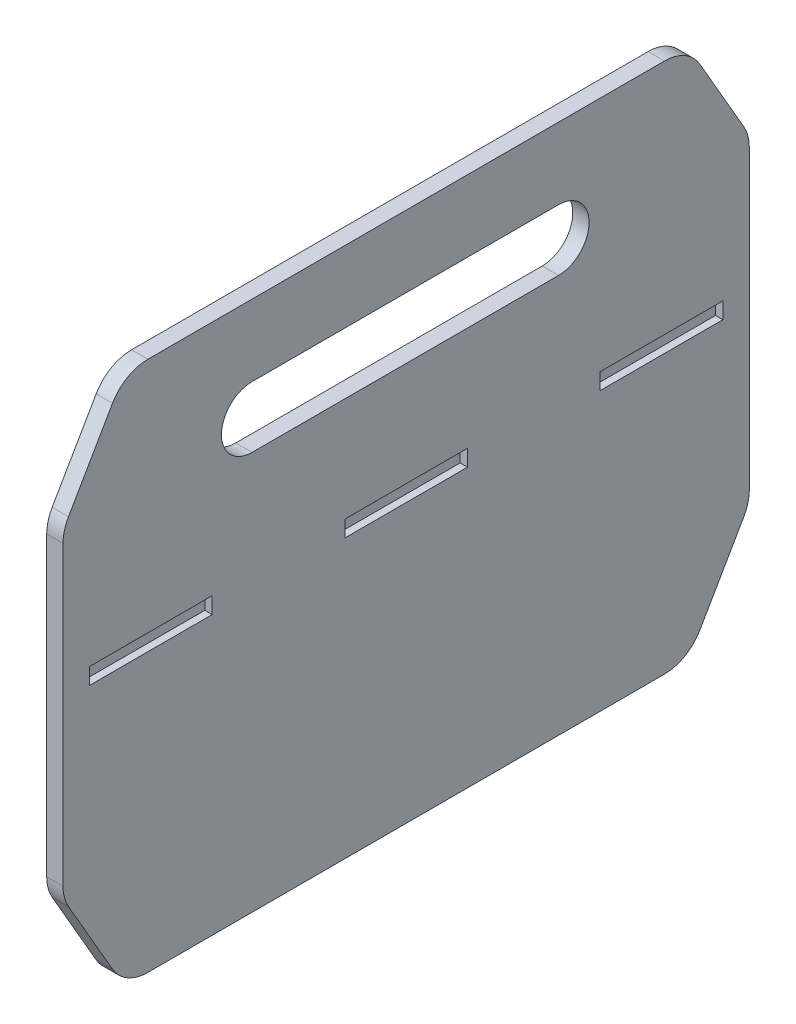
ISO-10303-21;
HEADER;
FILE_DESCRIPTION(('STEP AP214'),'2;1');
FILE_NAME('part.step','',(''),(''),'','','');
FILE_SCHEMA(('AUTOMOTIVE_DESIGN { 1 0 10303 214 1 1 1 1 }'));
ENDSEC;
DATA;
#1=APPLICATION_CONTEXT('core data for automotive mechanical design processes');
#2=APPLICATION_PROTOCOL_DEFINITION('international standard','automotive_design',2000,#1);
#3=PRODUCT_CONTEXT('',#1,'mechanical');
#4=PRODUCT('Part','Part','',(#3));
#5=PRODUCT_RELATED_PRODUCT_CATEGORY('part','',(#4));
#6=PRODUCT_DEFINITION_FORMATION('','',#4);
#7=PRODUCT_DEFINITION_CONTEXT('part definition',#1,'design');
#8=PRODUCT_DEFINITION('design','',#6,#7);
#9=PRODUCT_DEFINITION_SHAPE('','',#8);
#10=(LENGTH_UNIT() NAMED_UNIT(*) SI_UNIT(.MILLI.,.METRE.));
#11=(NAMED_UNIT(*) PLANE_ANGLE_UNIT() SI_UNIT($,.RADIAN.));
#12=(NAMED_UNIT(*) SI_UNIT($,.STERADIAN.) SOLID_ANGLE_UNIT());
#13=UNCERTAINTY_MEASURE_WITH_UNIT(LENGTH_MEASURE(1.E-05),#10,'distance_accuracy_value','');
#14=(GEOMETRIC_REPRESENTATION_CONTEXT(3) GLOBAL_UNCERTAINTY_ASSIGNED_CONTEXT((#13)) GLOBAL_UNIT_ASSIGNED_CONTEXT((#10,
#11,#12)) REPRESENTATION_CONTEXT('',''));
#15=CARTESIAN_POINT('',(0.,0.,0.));
#16=DIRECTION('',(0.,0.,1.));
#17=DIRECTION('',(1.,0.,0.));
#18=AXIS2_PLACEMENT_3D('',#15,#16,#17);
#19=CARTESIAN_POINT('',(-10.16,0.,212.802604436161));
#20=DIRECTION('',(0.,0.,1.));
#21=DIRECTION('',(1.,0.,0.));
#22=AXIS2_PLACEMENT_3D('',#19,#20,#21);
#23=PLANE('',#22);
#24=DIRECTION('',(0.,-1.,0.));
#25=VECTOR('',#24,1.);
#26=CARTESIAN_POINT('',(0.,0.,212.802604436161));
#27=LINE('',#26,#25);
#28=CARTESIAN_POINT('',(0.,206.602954743875,212.802604436161));
#29=VERTEX_POINT('',#28);
#30=CARTESIAN_POINT('',(0.,21.9970452561246,212.802604436161));
#31=VERTEX_POINT('',#30);
#32=EDGE_CURVE('E391',#29,#31,#27,.T.);
#33=ORIENTED_EDGE('',*,*,#32,.F.);
#34=DIRECTION('',(1.,0.,0.));
#35=VECTOR('',#34,1.);
#36=CARTESIAN_POINT('',(-10.16,206.602954743875,212.802604436161));
#37=LINE('',#36,#35);
#38=CARTESIAN_POINT('',(-10.16,206.602954743875,212.802604436161));
#39=VERTEX_POINT('',#38);
#40=EDGE_CURVE('E477',#29,#39,#37,.F.);
#41=ORIENTED_EDGE('',*,*,#40,.T.);
#42=DIRECTION('',(0.,-1.,0.));
#43=VECTOR('',#42,1.);
#44=CARTESIAN_POINT('',(-10.16,0.,212.802604436161));
#45=LINE('',#44,#43);
#46=CARTESIAN_POINT('',(-10.16,21.9970452561246,212.802604436161));
#47=VERTEX_POINT('',#46);
#48=EDGE_CURVE('E387',#39,#47,#45,.T.);
#49=ORIENTED_EDGE('',*,*,#48,.T.);
#50=DIRECTION('',(-1.,0.,0.));
#51=VECTOR('',#50,1.);
#52=CARTESIAN_POINT('',(-10.16,21.9970452561246,212.802604436161));
#53=LINE('',#52,#51);
#54=EDGE_CURVE('E474',#47,#31,#53,.F.);
#55=ORIENTED_EDGE('',*,*,#54,.T.);
#56=EDGE_LOOP('',(#33,#41,#49,#55));
#57=FACE_BOUND('',#56,.T.);
#58=ADVANCED_FACE('F40',(#57),#23,.T.);
#59=CARTESIAN_POINT('',(-10.16,279.4,212.802604436161));
#60=DIRECTION('',(0.,1.,0.));
#61=DIRECTION('',(0.,0.,1.));
#62=AXIS2_PLACEMENT_3D('',#59,#60,#61);
#63=PLANE('',#62);
#64=DIRECTION('',(0.,0.,1.));
#65=VECTOR('',#64,1.);
#66=CARTESIAN_POINT('',(-10.16,279.4,212.802604436161));
#67=LINE('',#66,#65);
#68=CARTESIAN_POINT('',(-10.16,279.4,-161.152698726423));
#69=VERTEX_POINT('',#68);
#70=CARTESIAN_POINT('',(-10.16,279.4,160.037907598744));
#71=VERTEX_POINT('',#70);
#72=EDGE_CURVE('E397',#69,#71,#67,.T.);
#73=ORIENTED_EDGE('',*,*,#72,.T.);
#74=DIRECTION('',(-1.,0.,0.));
#75=VECTOR('',#74,1.);
#76=CARTESIAN_POINT('',(-10.16,279.4,160.037907598744));
#77=LINE('',#76,#75);
#78=CARTESIAN_POINT('',(0.,279.4,160.037907598744));
#79=VERTEX_POINT('',#78);
#80=EDGE_CURVE('E436',#71,#79,#77,.F.);
#81=ORIENTED_EDGE('',*,*,#80,.T.);
#82=DIRECTION('',(0.,0.,1.));
#83=VECTOR('',#82,1.);
#84=CARTESIAN_POINT('',(0.,279.4,212.802604436161));
#85=LINE('',#84,#83);
#86=CARTESIAN_POINT('',(0.,279.4,-161.152698726423));
#87=VERTEX_POINT('',#86);
#88=EDGE_CURVE('E406',#87,#79,#85,.T.);
#89=ORIENTED_EDGE('',*,*,#88,.F.);
#90=DIRECTION('',(1.,0.,0.));
#91=VECTOR('',#90,1.);
#92=CARTESIAN_POINT('',(-10.16,279.4,-161.152698726423));
#93=LINE('',#92,#91);
#94=EDGE_CURVE('E433',#87,#69,#93,.F.);
#95=ORIENTED_EDGE('',*,*,#94,.T.);
#96=EDGE_LOOP('',(#73,#81,#89,#95));
#97=FACE_BOUND('',#96,.T.);
#98=ADVANCED_FACE('F508',(#97),#63,.T.);
#99=CARTESIAN_POINT('',(-10.16,254.,-213.917395563839));
#100=DIRECTION('',(0.,0.,-1.));
#101=DIRECTION('',(0.,1.,0.));
#102=AXIS2_PLACEMENT_3D('',#99,#100,#101);
#103=PLANE('',#102);
#104=DIRECTION('',(0.,1.,0.));
#105=VECTOR('',#104,1.);
#106=CARTESIAN_POINT('',(0.,254.,-213.917395563839));
#107=LINE('',#106,#105);
#108=CARTESIAN_POINT('',(0.,21.9970452561242,-213.917395563839));
#109=VERTEX_POINT('',#108);
#110=CARTESIAN_POINT('',(0.,206.602954743875,-213.917395563839));
#111=VERTEX_POINT('',#110);
#112=EDGE_CURVE('E403',#109,#111,#107,.T.);
#113=ORIENTED_EDGE('',*,*,#112,.F.);
#114=DIRECTION('',(1.,0.,0.));
#115=VECTOR('',#114,1.);
#116=CARTESIAN_POINT('',(-10.16,21.9970452561242,-213.917395563839));
#117=LINE('',#116,#115);
#118=CARTESIAN_POINT('',(-10.16,21.9970452561242,-213.917395563839));
#119=VERTEX_POINT('',#118);
#120=EDGE_CURVE('E497',#109,#119,#117,.F.);
#121=ORIENTED_EDGE('',*,*,#120,.T.);
#122=DIRECTION('',(0.,1.,0.));
#123=VECTOR('',#122,1.);
#124=CARTESIAN_POINT('',(-10.16,0.,-213.917395563839));
#125=LINE('',#124,#123);
#126=CARTESIAN_POINT('',(-10.16,206.602954743875,-213.917395563839));
#127=VERTEX_POINT('',#126);
#128=EDGE_CURVE('E394',#119,#127,#125,.T.);
#129=ORIENTED_EDGE('',*,*,#128,.T.);
#130=DIRECTION('',(-1.,0.,0.));
#131=VECTOR('',#130,1.);
#132=CARTESIAN_POINT('',(-10.16,206.602954743875,-213.917395563839));
#133=LINE('',#132,#131);
#134=EDGE_CURVE('E494',#127,#111,#133,.F.);
#135=ORIENTED_EDGE('',*,*,#134,.T.);
#136=EDGE_LOOP('',(#113,#121,#129,#135));
#137=FACE_BOUND('',#136,.T.);
#138=ADVANCED_FACE('F561',(#137),#103,.T.);
#139=CARTESIAN_POINT('',(-10.16,-50.8,212.802604436161));
#140=DIRECTION('',(0.,-1.,0.));
#141=DIRECTION('',(0.,0.,-1.));
#142=AXIS2_PLACEMENT_3D('',#139,#140,#141);
#143=PLANE('',#142);
#144=DIRECTION('',(0.,0.,-1.));
#145=VECTOR('',#144,1.);
#146=CARTESIAN_POINT('',(0.,-50.8,212.802604436161));
#147=LINE('',#146,#145);
#148=CARTESIAN_POINT('',(0.,-50.8,160.037907598744));
#149=VERTEX_POINT('',#148);
#150=CARTESIAN_POINT('',(0.,-50.8,-161.152698726423));
#151=VERTEX_POINT('',#150);
#152=EDGE_CURVE('E380',#149,#151,#147,.T.);
#153=ORIENTED_EDGE('',*,*,#152,.F.);
#154=DIRECTION('',(1.,0.,0.));
#155=VECTOR('',#154,1.);
#156=CARTESIAN_POINT('',(-10.16,-50.8,160.037907598744));
#157=LINE('',#156,#155);
#158=CARTESIAN_POINT('',(-10.16,-50.8,160.037907598744));
#159=VERTEX_POINT('',#158);
#160=EDGE_CURVE('E487',#149,#159,#157,.F.);
#161=ORIENTED_EDGE('',*,*,#160,.T.);
#162=DIRECTION('',(0.,0.,-1.));
#163=VECTOR('',#162,1.);
#164=CARTESIAN_POINT('',(-10.16,-50.8,212.802604436161));
#165=LINE('',#164,#163);
#166=CARTESIAN_POINT('',(-10.16,-50.8,-161.152698726423));
#167=VERTEX_POINT('',#166);
#168=EDGE_CURVE('E390',#159,#167,#165,.T.);
#169=ORIENTED_EDGE('',*,*,#168,.T.);
#170=DIRECTION('',(-1.,0.,0.));
#171=VECTOR('',#170,1.);
#172=CARTESIAN_POINT('',(-10.16,-50.8,-161.152698726423));
#173=LINE('',#172,#171);
#174=EDGE_CURVE('E484',#167,#151,#173,.F.);
#175=ORIENTED_EDGE('',*,*,#174,.T.);
#176=EDGE_LOOP('',(#153,#161,#169,#175));
#177=FACE_BOUND('',#176,.T.);
#178=ADVANCED_FACE('F543',(#177),#143,.T.);
#179=CARTESIAN_POINT('',(-10.16,0.,0.));
#180=DIRECTION('',(1.,0.,0.));
#181=DIRECTION('',(0.,0.,-1.));
#182=AXIS2_PLACEMENT_3D('',#179,#180,#181);
#183=PLANE('',#182);
#184=DIRECTION('',(0.,0.,1.));
#185=VECTOR('',#184,1.);
#186=CARTESIAN_POINT('',(-10.16,234.95,95.25));
#187=LINE('',#186,#185);
#188=CARTESIAN_POINT('',(-10.16,234.95,-95.25));
#189=VERTEX_POINT('',#188);
#190=CARTESIAN_POINT('',(-10.16,234.95,95.25));
#191=VERTEX_POINT('',#190);
#192=EDGE_CURVE('E365',#189,#191,#187,.T.);
#193=ORIENTED_EDGE('',*,*,#192,.T.);
#194=CARTESIAN_POINT('',(-10.16,215.9,95.25));
#195=DIRECTION('',(1.,0.,0.));
#196=DIRECTION('',(0.,0.,-1.));
#197=AXIS2_PLACEMENT_3D('',#194,#195,#196);
#198=CIRCLE('',#197,19.05);
#199=CARTESIAN_POINT('',(-10.16,196.85,95.25));
#200=VERTEX_POINT('',#199);
#201=EDGE_CURVE('E355',#191,#200,#198,.T.);
#202=ORIENTED_EDGE('',*,*,#201,.T.);
#203=DIRECTION('',(0.,0.,-1.));
#204=VECTOR('',#203,1.);
#205=CARTESIAN_POINT('',(-10.16,196.85,95.25));
#206=LINE('',#205,#204);
#207=CARTESIAN_POINT('',(-10.16,196.85,-95.25));
#208=VERTEX_POINT('',#207);
#209=EDGE_CURVE('E358',#200,#208,#206,.T.);
#210=ORIENTED_EDGE('',*,*,#209,.T.);
#211=CARTESIAN_POINT('',(-10.16,215.9,-95.25));
#212=DIRECTION('',(1.,0.,0.));
#213=DIRECTION('',(0.,0.,-1.));
#214=AXIS2_PLACEMENT_3D('',#211,#212,#213);
#215=CIRCLE('',#214,19.05);
#216=EDGE_CURVE('E362',#208,#189,#215,.T.);
#217=ORIENTED_EDGE('',*,*,#216,.T.);
#218=EDGE_LOOP('',(#193,#202,#210,#217));
#219=FACE_BOUND('',#218,.T.);
#220=DIRECTION('',(0.,-0.866025403784438,0.500000000000001));
#221=VECTOR('',#220,1.);
#222=CARTESIAN_POINT('',(-10.16,279.4,174.702604436161));
#223=LINE('',#222,#221);
#224=CARTESIAN_POINT('',(-10.16,219.302954743875,209.399649692285));
#225=VERTEX_POINT('',#224);
#226=CARTESIAN_POINT('',(-10.16,266.7,182.034952854869));
#227=VERTEX_POINT('',#226);
#228=EDGE_CURVE('E427',#225,#227,#223,.F.);
#229=ORIENTED_EDGE('',*,*,#228,.T.);
#230=CARTESIAN_POINT('',(-10.16,254.,160.037907598744));
#231=DIRECTION('',(1.,0.,0.));
#232=DIRECTION('',(0.,0.,-1.));
#233=AXIS2_PLACEMENT_3D('',#230,#231,#232);
#234=CIRCLE('',#233,25.4);
#235=EDGE_CURVE('E472',#227,#71,#234,.F.);
#236=ORIENTED_EDGE('',*,*,#235,.T.);
#237=ORIENTED_EDGE('',*,*,#72,.F.);
#238=CARTESIAN_POINT('',(-10.16,254.,-161.152698726423));
#239=DIRECTION('',(1.,0.,0.));
#240=DIRECTION('',(0.,0.,-1.));
#241=AXIS2_PLACEMENT_3D('',#238,#239,#240);
#242=CIRCLE('',#241,25.4);
#243=CARTESIAN_POINT('',(-10.16,266.7,-183.149743982548));
#244=VERTEX_POINT('',#243);
#245=EDGE_CURVE('E60',#69,#244,#242,.F.);
#246=ORIENTED_EDGE('',*,*,#245,.T.);
#247=DIRECTION('',(0.,0.866025403784438,0.500000000000001));
#248=VECTOR('',#247,1.);
#249=CARTESIAN_POINT('',(-10.16,213.408864231626,-213.917395563839));
#250=LINE('',#249,#248);
#251=CARTESIAN_POINT('',(-10.16,219.302954743875,-210.514440819964));
#252=VERTEX_POINT('',#251);
#253=EDGE_CURVE('E422',#244,#252,#250,.F.);
#254=ORIENTED_EDGE('',*,*,#253,.T.);
#255=CARTESIAN_POINT('',(-10.16,206.602954743875,-188.517395563839));
#256=DIRECTION('',(1.,0.,0.));
#257=DIRECTION('',(0.,0.,-1.));
#258=AXIS2_PLACEMENT_3D('',#255,#256,#257);
#259=CIRCLE('',#258,25.4);
#260=EDGE_CURVE('E460',#252,#127,#259,.F.);
#261=ORIENTED_EDGE('',*,*,#260,.T.);
#262=ORIENTED_EDGE('',*,*,#128,.F.);
#263=CARTESIAN_POINT('',(-10.16,21.9970452561242,-188.517395563839));
#264=DIRECTION('',(1.,0.,0.));
#265=DIRECTION('',(0.,0.,-1.));
#266=AXIS2_PLACEMENT_3D('',#263,#264,#265);
#267=CIRCLE('',#266,25.4);
#268=CARTESIAN_POINT('',(-10.16,9.29704525612422,-210.514440819964));
#269=VERTEX_POINT('',#268);
#270=EDGE_CURVE('E462',#119,#269,#267,.F.);
#271=ORIENTED_EDGE('',*,*,#270,.T.);
#272=DIRECTION('',(0.,0.866025403784438,-0.500000000000001));
#273=VECTOR('',#272,1.);
#274=CARTESIAN_POINT('',(-10.16,-50.8,-175.817395563839));
#275=LINE('',#274,#273);
#276=CARTESIAN_POINT('',(-10.16,-38.1,-183.149743982548));
#277=VERTEX_POINT('',#276);
#278=EDGE_CURVE('E430',#269,#277,#275,.F.);
#279=ORIENTED_EDGE('',*,*,#278,.T.);
#280=CARTESIAN_POINT('',(-10.16,-25.4,-161.152698726423));
#281=DIRECTION('',(1.,0.,0.));
#282=DIRECTION('',(0.,0.,-1.));
#283=AXIS2_PLACEMENT_3D('',#280,#281,#282);
#284=CIRCLE('',#283,25.4);
#285=EDGE_CURVE('E464',#277,#167,#284,.F.);
#286=ORIENTED_EDGE('',*,*,#285,.T.);
#287=ORIENTED_EDGE('',*,*,#168,.F.);
#288=CARTESIAN_POINT('',(-10.16,-25.4,160.037907598744));
#289=DIRECTION('',(1.,0.,0.));
#290=DIRECTION('',(0.,0.,-1.));
#291=AXIS2_PLACEMENT_3D('',#288,#289,#290);
#292=CIRCLE('',#291,25.4);
#293=CARTESIAN_POINT('',(-10.16,-38.1,182.034952854869));
#294=VERTEX_POINT('',#293);
#295=EDGE_CURVE('E466',#159,#294,#292,.F.);
#296=ORIENTED_EDGE('',*,*,#295,.T.);
#297=DIRECTION('',(0.,-0.866025403784438,-0.500000000000001));
#298=VECTOR('',#297,1.);
#299=CARTESIAN_POINT('',(-10.16,15.1911357683741,212.802604436161));
#300=LINE('',#299,#298);
#301=CARTESIAN_POINT('',(-10.16,9.29704525612456,209.399649692285));
#302=VERTEX_POINT('',#301);
#303=EDGE_CURVE('E424',#294,#302,#300,.F.);
#304=ORIENTED_EDGE('',*,*,#303,.T.);
#305=CARTESIAN_POINT('',(-10.16,21.9970452561246,187.402604436161));
#306=DIRECTION('',(1.,0.,0.));
#307=DIRECTION('',(0.,0.,-1.));
#308=AXIS2_PLACEMENT_3D('',#305,#306,#307);
#309=CIRCLE('',#308,25.4);
#310=EDGE_CURVE('E468',#302,#47,#309,.F.);
#311=ORIENTED_EDGE('',*,*,#310,.T.);
#312=ORIENTED_EDGE('',*,*,#48,.F.);
#313=CARTESIAN_POINT('',(-10.16,206.602954743875,187.402604436161));
#314=DIRECTION('',(1.,0.,0.));
#315=DIRECTION('',(0.,0.,-1.));
#316=AXIS2_PLACEMENT_3D('',#313,#314,#315);
#317=CIRCLE('',#316,25.4);
#318=EDGE_CURVE('E470',#39,#225,#317,.F.);
#319=ORIENTED_EDGE('',*,*,#318,.T.);
#320=EDGE_LOOP('',(#229,#236,#237,#246,#254,#261,#262,#271,#279,#286,#287,#296,#304,#311,#312,#319));
#321=FACE_BOUND('',#320,.T.);
#322=ADVANCED_FACE('F510',(#219,#321),#183,.F.);
#323=CARTESIAN_POINT('',(0.,0.,0.));
#324=DIRECTION('',(1.,0.,0.));
#325=DIRECTION('',(0.,0.,-1.));
#326=AXIS2_PLACEMENT_3D('',#323,#324,#325);
#327=PLANE('',#326);
#328=DIRECTION('',(0.,-1.,0.));
#329=VECTOR('',#328,1.);
#330=CARTESIAN_POINT('',(0.,132.08,196.292604436161));
#331=LINE('',#330,#329);
#332=CARTESIAN_POINT('',(0.,132.08,196.292604436161));
#333=VERTEX_POINT('',#332);
#334=CARTESIAN_POINT('',(0.,121.92,196.292604436161));
#335=VERTEX_POINT('',#334);
#336=EDGE_CURVE('E255',#333,#335,#331,.T.);
#337=ORIENTED_EDGE('',*,*,#336,.F.);
#338=DIRECTION('',(0.,0.,1.));
#339=VECTOR('',#338,1.);
#340=CARTESIAN_POINT('',(0.,132.08,196.292604436161));
#341=LINE('',#340,#339);
#342=CARTESIAN_POINT('',(0.,132.08,120.092604436161));
#343=VERTEX_POINT('',#342);
#344=EDGE_CURVE('E272',#343,#333,#341,.T.);
#345=ORIENTED_EDGE('',*,*,#344,.F.);
#346=DIRECTION('',(0.,1.,0.));
#347=VECTOR('',#346,1.);
#348=CARTESIAN_POINT('',(0.,132.08,120.092604436161));
#349=LINE('',#348,#347);
#350=CARTESIAN_POINT('',(0.,121.92,120.092604436161));
#351=VERTEX_POINT('',#350);
#352=EDGE_CURVE('E275',#351,#343,#349,.T.);
#353=ORIENTED_EDGE('',*,*,#352,.F.);
#354=DIRECTION('',(0.,0.,-1.));
#355=VECTOR('',#354,1.);
#356=CARTESIAN_POINT('',(0.,121.92,196.292604436161));
#357=LINE('',#356,#355);
#358=EDGE_CURVE('E281',#335,#351,#357,.T.);
#359=ORIENTED_EDGE('',*,*,#358,.F.);
#360=EDGE_LOOP('',(#337,#345,#353,#359));
#361=FACE_BOUND('',#360,.T.);
#362=DIRECTION('',(0.,-1.,0.));
#363=VECTOR('',#362,1.);
#364=CARTESIAN_POINT('',(0.,132.08,37.5426044361607));
#365=LINE('',#364,#363);
#366=CARTESIAN_POINT('',(0.,132.08,37.5426044361607));
#367=VERTEX_POINT('',#366);
#368=CARTESIAN_POINT('',(0.,121.92,37.5426044361607));
#369=VERTEX_POINT('',#368);
#370=EDGE_CURVE('E306',#367,#369,#365,.T.);
#371=ORIENTED_EDGE('',*,*,#370,.F.);
#372=DIRECTION('',(0.,0.,1.));
#373=VECTOR('',#372,1.);
#374=CARTESIAN_POINT('',(0.,132.08,37.5426044361607));
#375=LINE('',#374,#373);
#376=CARTESIAN_POINT('',(0.,132.08,-38.6573955638393));
#377=VERTEX_POINT('',#376);
#378=EDGE_CURVE('E296',#377,#367,#375,.T.);
#379=ORIENTED_EDGE('',*,*,#378,.F.);
#380=DIRECTION('',(0.,1.,0.));
#381=VECTOR('',#380,1.);
#382=CARTESIAN_POINT('',(0.,132.08,-38.6573955638393));
#383=LINE('',#382,#381);
#384=CARTESIAN_POINT('',(0.,121.92,-38.6573955638393));
#385=VERTEX_POINT('',#384);
#386=EDGE_CURVE('E312',#385,#377,#383,.T.);
#387=ORIENTED_EDGE('',*,*,#386,.F.);
#388=DIRECTION('',(0.,0.,-1.));
#389=VECTOR('',#388,1.);
#390=CARTESIAN_POINT('',(0.,121.92,37.5426044361607));
#391=LINE('',#390,#389);
#392=EDGE_CURVE('E308',#369,#385,#391,.T.);
#393=ORIENTED_EDGE('',*,*,#392,.F.);
#394=EDGE_LOOP('',(#371,#379,#387,#393));
#395=FACE_BOUND('',#394,.T.);
#396=DIRECTION('',(0.,-1.,0.));
#397=VECTOR('',#396,1.);
#398=CARTESIAN_POINT('',(0.,132.08,-121.207395563839));
#399=LINE('',#398,#397);
#400=CARTESIAN_POINT('',(0.,132.08,-121.207395563839));
#401=VERTEX_POINT('',#400);
#402=CARTESIAN_POINT('',(0.,121.92,-121.207395563839));
#403=VERTEX_POINT('',#402);
#404=EDGE_CURVE('E338',#401,#403,#399,.T.);
#405=ORIENTED_EDGE('',*,*,#404,.F.);
#406=DIRECTION('',(0.,0.,1.));
#407=VECTOR('',#406,1.);
#408=CARTESIAN_POINT('',(0.,132.08,-121.207395563839));
#409=LINE('',#408,#407);
#410=CARTESIAN_POINT('',(0.,132.08,-197.407395563839));
#411=VERTEX_POINT('',#410);
#412=EDGE_CURVE('E328',#411,#401,#409,.T.);
#413=ORIENTED_EDGE('',*,*,#412,.F.);
#414=DIRECTION('',(0.,1.,0.));
#415=VECTOR('',#414,1.);
#416=CARTESIAN_POINT('',(0.,132.08,-197.407395563839));
#417=LINE('',#416,#415);
#418=CARTESIAN_POINT('',(0.,121.92,-197.407395563839));
#419=VERTEX_POINT('',#418);
#420=EDGE_CURVE('E343',#419,#411,#417,.T.);
#421=ORIENTED_EDGE('',*,*,#420,.F.);
#422=DIRECTION('',(0.,0.,-1.));
#423=VECTOR('',#422,1.);
#424=CARTESIAN_POINT('',(0.,121.92,-121.207395563839));
#425=LINE('',#424,#423);
#426=EDGE_CURVE('E340',#403,#419,#425,.T.);
#427=ORIENTED_EDGE('',*,*,#426,.F.);
#428=EDGE_LOOP('',(#405,#413,#421,#427));
#429=FACE_BOUND('',#428,.T.);
#430=CARTESIAN_POINT('',(0.,215.9,95.25));
#431=DIRECTION('',(1.,0.,0.));
#432=DIRECTION('',(0.,0.,-1.));
#433=AXIS2_PLACEMENT_3D('',#430,#431,#432);
#434=CIRCLE('',#433,19.05);
#435=CARTESIAN_POINT('',(0.,234.95,95.25));
#436=VERTEX_POINT('',#435);
#437=CARTESIAN_POINT('',(0.,196.85,95.25));
#438=VERTEX_POINT('',#437);
#439=EDGE_CURVE('E288',#436,#438,#434,.T.);
#440=ORIENTED_EDGE('',*,*,#439,.F.);
#441=DIRECTION('',(0.,0.,1.));
#442=VECTOR('',#441,1.);
#443=CARTESIAN_POINT('',(0.,234.95,95.25));
#444=LINE('',#443,#442);
#445=CARTESIAN_POINT('',(0.,234.95,-95.25));
#446=VERTEX_POINT('',#445);
#447=EDGE_CURVE('E359',#446,#436,#444,.T.);
#448=ORIENTED_EDGE('',*,*,#447,.F.);
#449=CARTESIAN_POINT('',(0.,215.9,-95.25));
#450=DIRECTION('',(1.,0.,0.));
#451=DIRECTION('',(0.,0.,-1.));
#452=AXIS2_PLACEMENT_3D('',#449,#450,#451);
#453=CIRCLE('',#452,19.05);
#454=CARTESIAN_POINT('',(0.,196.85,-95.25));
#455=VERTEX_POINT('',#454);
#456=EDGE_CURVE('E373',#455,#446,#453,.T.);
#457=ORIENTED_EDGE('',*,*,#456,.F.);
#458=DIRECTION('',(0.,0.,-1.));
#459=VECTOR('',#458,1.);
#460=CARTESIAN_POINT('',(0.,196.85,95.25));
#461=LINE('',#460,#459);
#462=EDGE_CURVE('E370',#438,#455,#461,.T.);
#463=ORIENTED_EDGE('',*,*,#462,.F.);
#464=EDGE_LOOP('',(#440,#448,#457,#463));
#465=FACE_BOUND('',#464,.T.);
#466=ORIENTED_EDGE('',*,*,#88,.T.);
#467=CARTESIAN_POINT('',(0.,254.,160.037907598744));
#468=DIRECTION('',(1.,0.,0.));
#469=DIRECTION('',(0.,0.,-1.));
#470=AXIS2_PLACEMENT_3D('',#467,#468,#469);
#471=CIRCLE('',#470,25.4);
#472=CARTESIAN_POINT('',(0.,266.7,182.034952854869));
#473=VERTEX_POINT('',#472);
#474=EDGE_CURVE('E453',#79,#473,#471,.T.);
#475=ORIENTED_EDGE('',*,*,#474,.T.);
#476=DIRECTION('',(0.,0.866025403784438,-0.500000000000001));
#477=VECTOR('',#476,1.);
#478=CARTESIAN_POINT('',(0.,145.49844677451,252.010702235807));
#479=LINE('',#478,#477);
#480=CARTESIAN_POINT('',(0.,219.302954743875,209.399649692285));
#481=VERTEX_POINT('',#480);
#482=EDGE_CURVE('E416',#473,#481,#479,.F.);
#483=ORIENTED_EDGE('',*,*,#482,.T.);
#484=CARTESIAN_POINT('',(0.,206.602954743875,187.402604436161));
#485=DIRECTION('',(1.,0.,0.));
#486=DIRECTION('',(0.,0.,-1.));
#487=AXIS2_PLACEMENT_3D('',#484,#485,#486);
#488=CIRCLE('',#487,25.4);
#489=EDGE_CURVE('E451',#481,#29,#488,.T.);
#490=ORIENTED_EDGE('',*,*,#489,.T.);
#491=ORIENTED_EDGE('',*,*,#32,.T.);
#492=CARTESIAN_POINT('',(0.,21.9970452561246,187.402604436161));
#493=DIRECTION('',(1.,0.,0.));
#494=DIRECTION('',(0.,0.,-1.));
#495=AXIS2_PLACEMENT_3D('',#492,#493,#494);
#496=CIRCLE('',#495,25.4);
#497=CARTESIAN_POINT('',(0.,9.29704525612457,209.399649692285));
#498=VERTEX_POINT('',#497);
#499=EDGE_CURVE('E449',#31,#498,#496,.T.);
#500=ORIENTED_EDGE('',*,*,#499,.T.);
#501=DIRECTION('',(0.,0.866025403784438,0.500000000000001));
#502=VECTOR('',#501,1.);
#503=CARTESIAN_POINT('',(0.,-88.3484467745097,153.023998583245));
#504=LINE('',#503,#502);
#505=CARTESIAN_POINT('',(0.,-38.1,182.034952854869));
#506=VERTEX_POINT('',#505);
#507=EDGE_CURVE('E413',#498,#506,#504,.F.);
#508=ORIENTED_EDGE('',*,*,#507,.T.);
#509=CARTESIAN_POINT('',(0.,-25.4,160.037907598744));
#510=DIRECTION('',(1.,0.,0.));
#511=DIRECTION('',(0.,0.,-1.));
#512=AXIS2_PLACEMENT_3D('',#509,#510,#511);
#513=CIRCLE('',#512,25.4);
#514=EDGE_CURVE('E447',#506,#149,#513,.T.);
#515=ORIENTED_EDGE('',*,*,#514,.T.);
#516=ORIENTED_EDGE('',*,*,#152,.T.);
#517=CARTESIAN_POINT('',(0.,-25.4,-161.152698726423));
#518=DIRECTION('',(1.,0.,0.));
#519=DIRECTION('',(0.,0.,-1.));
#520=AXIS2_PLACEMENT_3D('',#517,#518,#519);
#521=CIRCLE('',#520,25.4);
#522=CARTESIAN_POINT('',(0.,-38.1,-183.149743982548));
#523=VERTEX_POINT('',#522);
#524=EDGE_CURVE('E445',#151,#523,#521,.T.);
#525=ORIENTED_EDGE('',*,*,#524,.T.);
#526=DIRECTION('',(0.,-0.866025403784438,0.500000000000001));
#527=VECTOR('',#526,1.);
#528=CARTESIAN_POINT('',(0.,-88.8311654927512,-153.860091929004));
#529=LINE('',#528,#527);
#530=CARTESIAN_POINT('',(0.,9.29704525612421,-210.514440819964));
#531=VERTEX_POINT('',#530);
#532=EDGE_CURVE('E419',#523,#531,#529,.F.);
#533=ORIENTED_EDGE('',*,*,#532,.T.);
#534=CARTESIAN_POINT('',(0.,21.9970452561242,-188.517395563839));
#535=DIRECTION('',(1.,0.,0.));
#536=DIRECTION('',(0.,0.,-1.));
#537=AXIS2_PLACEMENT_3D('',#534,#535,#536);
#538=CIRCLE('',#537,25.4);
#539=EDGE_CURVE('E443',#531,#109,#538,.T.);
#540=ORIENTED_EDGE('',*,*,#539,.T.);
#541=ORIENTED_EDGE('',*,*,#112,.T.);
#542=CARTESIAN_POINT('',(0.,206.602954743875,-188.517395563839));
#543=DIRECTION('',(1.,0.,0.));
#544=DIRECTION('',(0.,0.,-1.));
#545=AXIS2_PLACEMENT_3D('',#542,#543,#544);
#546=CIRCLE('',#545,25.4);
#547=CARTESIAN_POINT('',(0.,219.302954743875,-210.514440819964));
#548=VERTEX_POINT('',#547);
#549=EDGE_CURVE('E441',#111,#548,#546,.T.);
#550=ORIENTED_EDGE('',*,*,#549,.T.);
#551=DIRECTION('',(0.,-0.866025403784438,-0.500000000000001));
#552=VECTOR('',#551,1.);
#553=CARTESIAN_POINT('',(0.,145.981165492751,-252.846795581565));
#554=LINE('',#553,#552);
#555=CARTESIAN_POINT('',(0.,266.7,-183.149743982547));
#556=VERTEX_POINT('',#555);
#557=EDGE_CURVE('E400',#548,#556,#554,.F.);
#558=ORIENTED_EDGE('',*,*,#557,.T.);
#559=CARTESIAN_POINT('',(0.,254.,-161.152698726423));
#560=DIRECTION('',(1.,0.,0.));
#561=DIRECTION('',(0.,0.,-1.));
#562=AXIS2_PLACEMENT_3D('',#559,#560,#561);
#563=CIRCLE('',#562,25.4);
#564=EDGE_CURVE('E439',#556,#87,#563,.T.);
#565=ORIENTED_EDGE('',*,*,#564,.T.);
#566=EDGE_LOOP('',(#466,#475,#483,#490,#491,#500,#508,#515,#516,#525,#533,#540,#541,#550,#558,#565));
#567=FACE_BOUND('',#566,.T.);
#568=ADVANCED_FACE('F504',(#361,#395,#429,#465,#567),#327,.T.);
#569=CARTESIAN_POINT('',(-10.16,215.9,95.25));
#570=DIRECTION('',(1.,0.,0.));
#571=DIRECTION('',(0.,0.,-1.));
#572=AXIS2_PLACEMENT_3D('',#569,#570,#571);
#573=CYLINDRICAL_SURFACE('',#572,19.05);
#574=ORIENTED_EDGE('',*,*,#439,.T.);
#575=DIRECTION('',(1.,0.,0.));
#576=VECTOR('',#575,1.);
#577=CARTESIAN_POINT('',(-10.16,196.85,95.25));
#578=LINE('',#577,#576);
#579=EDGE_CURVE('E368',#200,#438,#578,.T.);
#580=ORIENTED_EDGE('',*,*,#579,.F.);
#581=ORIENTED_EDGE('',*,*,#201,.F.);
#582=DIRECTION('',(1.,0.,0.));
#583=VECTOR('',#582,1.);
#584=CARTESIAN_POINT('',(-10.16,234.95,95.25));
#585=LINE('',#584,#583);
#586=EDGE_CURVE('E378',#191,#436,#585,.T.);
#587=ORIENTED_EDGE('',*,*,#586,.T.);
#588=EDGE_LOOP('',(#574,#580,#581,#587));
#589=FACE_BOUND('',#588,.T.);
#590=ADVANCED_FACE('F864',(#589),#573,.F.);
#591=CARTESIAN_POINT('',(-10.16,234.95,95.25));
#592=DIRECTION('',(0.,1.,0.));
#593=DIRECTION('',(0.,0.,1.));
#594=AXIS2_PLACEMENT_3D('',#591,#592,#593);
#595=PLANE('',#594);
#596=ORIENTED_EDGE('',*,*,#447,.T.);
#597=ORIENTED_EDGE('',*,*,#586,.F.);
#598=ORIENTED_EDGE('',*,*,#192,.F.);
#599=DIRECTION('',(1.,0.,0.));
#600=VECTOR('',#599,1.);
#601=CARTESIAN_POINT('',(-10.16,234.95,-95.25));
#602=LINE('',#601,#600);
#603=EDGE_CURVE('E381',#189,#446,#602,.T.);
#604=ORIENTED_EDGE('',*,*,#603,.T.);
#605=EDGE_LOOP('',(#596,#597,#598,#604));
#606=FACE_BOUND('',#605,.T.);
#607=ADVANCED_FACE('F854',(#606),#595,.F.);
#608=CARTESIAN_POINT('',(-10.16,215.9,-95.25));
#609=DIRECTION('',(1.,0.,0.));
#610=DIRECTION('',(0.,0.,-1.));
#611=AXIS2_PLACEMENT_3D('',#608,#609,#610);
#612=CYLINDRICAL_SURFACE('',#611,19.05);
#613=ORIENTED_EDGE('',*,*,#456,.T.);
#614=ORIENTED_EDGE('',*,*,#603,.F.);
#615=ORIENTED_EDGE('',*,*,#216,.F.);
#616=DIRECTION('',(1.,0.,0.));
#617=VECTOR('',#616,1.);
#618=CARTESIAN_POINT('',(-10.16,196.85,-95.25));
#619=LINE('',#618,#617);
#620=EDGE_CURVE('E383',#208,#455,#619,.T.);
#621=ORIENTED_EDGE('',*,*,#620,.T.);
#622=EDGE_LOOP('',(#613,#614,#615,#621));
#623=FACE_BOUND('',#622,.T.);
#624=ADVANCED_FACE('F844',(#623),#612,.F.);
#625=CARTESIAN_POINT('',(-10.16,196.85,95.25));
#626=DIRECTION('',(0.,-1.,0.));
#627=DIRECTION('',(0.,0.,-1.));
#628=AXIS2_PLACEMENT_3D('',#625,#626,#627);
#629=PLANE('',#628);
#630=ORIENTED_EDGE('',*,*,#462,.T.);
#631=ORIENTED_EDGE('',*,*,#620,.F.);
#632=ORIENTED_EDGE('',*,*,#209,.F.);
#633=ORIENTED_EDGE('',*,*,#579,.T.);
#634=EDGE_LOOP('',(#630,#631,#632,#633));
#635=FACE_BOUND('',#634,.T.);
#636=ADVANCED_FACE('F834',(#635),#629,.F.);
#637=CARTESIAN_POINT('',(-4.572,132.08,-121.207395563839));
#638=DIRECTION('',(0.,0.,1.));
#639=DIRECTION('',(1.,0.,0.));
#640=AXIS2_PLACEMENT_3D('',#637,#638,#639);
#641=PLANE('',#640);
#642=ORIENTED_EDGE('',*,*,#404,.T.);
#643=DIRECTION('',(1.,0.,0.));
#644=VECTOR('',#643,1.);
#645=CARTESIAN_POINT('',(-4.572,121.92,-121.207395563839));
#646=LINE('',#645,#644);
#647=CARTESIAN_POINT('',(-4.572,121.92,-121.207395563839));
#648=VERTEX_POINT('',#647);
#649=EDGE_CURVE('E337',#648,#403,#646,.T.);
#650=ORIENTED_EDGE('',*,*,#649,.F.);
#651=DIRECTION('',(0.,-1.,0.));
#652=VECTOR('',#651,1.);
#653=CARTESIAN_POINT('',(-4.572,132.08,-121.207395563839));
#654=LINE('',#653,#652);
#655=CARTESIAN_POINT('',(-4.572,132.08,-121.207395563839));
#656=VERTEX_POINT('',#655);
#657=EDGE_CURVE('E324',#656,#648,#654,.T.);
#658=ORIENTED_EDGE('',*,*,#657,.F.);
#659=DIRECTION('',(1.,0.,0.));
#660=VECTOR('',#659,1.);
#661=CARTESIAN_POINT('',(-4.572,132.08,-121.207395563839));
#662=LINE('',#661,#660);
#663=EDGE_CURVE('E309',#656,#401,#662,.T.);
#664=ORIENTED_EDGE('',*,*,#663,.T.);
#665=EDGE_LOOP('',(#642,#650,#658,#664));
#666=FACE_BOUND('',#665,.T.);
#667=ADVANCED_FACE('F824',(#666),#641,.F.);
#668=CARTESIAN_POINT('',(-4.572,132.08,-121.207395563839));
#669=DIRECTION('',(0.,1.,0.));
#670=DIRECTION('',(0.,0.,1.));
#671=AXIS2_PLACEMENT_3D('',#668,#669,#670);
#672=PLANE('',#671);
#673=ORIENTED_EDGE('',*,*,#412,.T.);
#674=ORIENTED_EDGE('',*,*,#663,.F.);
#675=DIRECTION('',(0.,0.,1.));
#676=VECTOR('',#675,1.);
#677=CARTESIAN_POINT('',(-4.572,132.08,-121.207395563839));
#678=LINE('',#677,#676);
#679=CARTESIAN_POINT('',(-4.572,132.08,-197.407395563839));
#680=VERTEX_POINT('',#679);
#681=EDGE_CURVE('E334',#680,#656,#678,.T.);
#682=ORIENTED_EDGE('',*,*,#681,.F.);
#683=DIRECTION('',(1.,0.,0.));
#684=VECTOR('',#683,1.);
#685=CARTESIAN_POINT('',(-4.572,132.08,-197.407395563839));
#686=LINE('',#685,#684);
#687=EDGE_CURVE('E349',#680,#411,#686,.T.);
#688=ORIENTED_EDGE('',*,*,#687,.T.);
#689=EDGE_LOOP('',(#673,#674,#682,#688));
#690=FACE_BOUND('',#689,.T.);
#691=ADVANCED_FACE('F814',(#690),#672,.F.);
#692=CARTESIAN_POINT('',(-4.572,132.08,-197.407395563839));
#693=DIRECTION('',(0.,0.,-1.));
#694=DIRECTION('',(-1.,0.,0.));
#695=AXIS2_PLACEMENT_3D('',#692,#693,#694);
#696=PLANE('',#695);
#697=ORIENTED_EDGE('',*,*,#420,.T.);
#698=ORIENTED_EDGE('',*,*,#687,.F.);
#699=DIRECTION('',(0.,1.,0.));
#700=VECTOR('',#699,1.);
#701=CARTESIAN_POINT('',(-4.572,132.08,-197.407395563839));
#702=LINE('',#701,#700);
#703=CARTESIAN_POINT('',(-4.572,121.92,-197.407395563839));
#704=VERTEX_POINT('',#703);
#705=EDGE_CURVE('E331',#704,#680,#702,.T.);
#706=ORIENTED_EDGE('',*,*,#705,.F.);
#707=DIRECTION('',(1.,0.,0.));
#708=VECTOR('',#707,1.);
#709=CARTESIAN_POINT('',(-4.572,121.92,-197.407395563839));
#710=LINE('',#709,#708);
#711=EDGE_CURVE('E351',#704,#419,#710,.T.);
#712=ORIENTED_EDGE('',*,*,#711,.T.);
#713=EDGE_LOOP('',(#697,#698,#706,#712));
#714=FACE_BOUND('',#713,.T.);
#715=ADVANCED_FACE('F804',(#714),#696,.F.);
#716=CARTESIAN_POINT('',(-4.572,121.92,-121.207395563839));
#717=DIRECTION('',(0.,-1.,0.));
#718=DIRECTION('',(0.,0.,-1.));
#719=AXIS2_PLACEMENT_3D('',#716,#717,#718);
#720=PLANE('',#719);
#721=ORIENTED_EDGE('',*,*,#426,.T.);
#722=ORIENTED_EDGE('',*,*,#711,.F.);
#723=DIRECTION('',(0.,0.,-1.));
#724=VECTOR('',#723,1.);
#725=CARTESIAN_POINT('',(-4.572,121.92,-121.207395563839));
#726=LINE('',#725,#724);
#727=EDGE_CURVE('E327',#648,#704,#726,.T.);
#728=ORIENTED_EDGE('',*,*,#727,.F.);
#729=ORIENTED_EDGE('',*,*,#649,.T.);
#730=EDGE_LOOP('',(#721,#722,#728,#729));
#731=FACE_BOUND('',#730,.T.);
#732=ADVANCED_FACE('F794',(#731),#720,.F.);
#733=CARTESIAN_POINT('',(-4.572,0.,0.));
#734=DIRECTION('',(1.,0.,0.));
#735=DIRECTION('',(0.,0.,-1.));
#736=AXIS2_PLACEMENT_3D('',#733,#734,#735);
#737=PLANE('',#736);
#738=ORIENTED_EDGE('',*,*,#657,.T.);
#739=ORIENTED_EDGE('',*,*,#727,.T.);
#740=ORIENTED_EDGE('',*,*,#705,.T.);
#741=ORIENTED_EDGE('',*,*,#681,.T.);
#742=EDGE_LOOP('',(#738,#739,#740,#741));
#743=FACE_BOUND('',#742,.T.);
#744=ADVANCED_FACE('F784',(#743),#737,.T.);
#745=CARTESIAN_POINT('',(-4.572,132.08,37.5426044361607));
#746=DIRECTION('',(0.,0.,1.));
#747=DIRECTION('',(1.,0.,0.));
#748=AXIS2_PLACEMENT_3D('',#745,#746,#747);
#749=PLANE('',#748);
#750=ORIENTED_EDGE('',*,*,#370,.T.);
#751=DIRECTION('',(1.,0.,0.));
#752=VECTOR('',#751,1.);
#753=CARTESIAN_POINT('',(-4.572,121.92,37.5426044361607));
#754=LINE('',#753,#752);
#755=CARTESIAN_POINT('',(-4.572,121.92,37.5426044361607));
#756=VERTEX_POINT('',#755);
#757=EDGE_CURVE('E305',#756,#369,#754,.T.);
#758=ORIENTED_EDGE('',*,*,#757,.F.);
#759=DIRECTION('',(0.,-1.,0.));
#760=VECTOR('',#759,1.);
#761=CARTESIAN_POINT('',(-4.572,132.08,37.5426044361607));
#762=LINE('',#761,#760);
#763=CARTESIAN_POINT('',(-4.572,132.08,37.5426044361607));
#764=VERTEX_POINT('',#763);
#765=EDGE_CURVE('E292',#764,#756,#762,.T.);
#766=ORIENTED_EDGE('',*,*,#765,.F.);
#767=DIRECTION('',(1.,0.,0.));
#768=VECTOR('',#767,1.);
#769=CARTESIAN_POINT('',(-4.572,132.08,37.5426044361607));
#770=LINE('',#769,#768);
#771=EDGE_CURVE('E282',#764,#367,#770,.T.);
#772=ORIENTED_EDGE('',*,*,#771,.T.);
#773=EDGE_LOOP('',(#750,#758,#766,#772));
#774=FACE_BOUND('',#773,.T.);
#775=ADVANCED_FACE('F774',(#774),#749,.F.);
#776=CARTESIAN_POINT('',(-4.572,132.08,37.5426044361607));
#777=DIRECTION('',(0.,1.,0.));
#778=DIRECTION('',(0.,0.,1.));
#779=AXIS2_PLACEMENT_3D('',#776,#777,#778);
#780=PLANE('',#779);
#781=ORIENTED_EDGE('',*,*,#378,.T.);
#782=ORIENTED_EDGE('',*,*,#771,.F.);
#783=DIRECTION('',(0.,0.,1.));
#784=VECTOR('',#783,1.);
#785=CARTESIAN_POINT('',(-4.572,132.08,37.5426044361607));
#786=LINE('',#785,#784);
#787=CARTESIAN_POINT('',(-4.572,132.08,-38.6573955638393));
#788=VERTEX_POINT('',#787);
#789=EDGE_CURVE('E302',#788,#764,#786,.T.);
#790=ORIENTED_EDGE('',*,*,#789,.F.);
#791=DIRECTION('',(1.,0.,0.));
#792=VECTOR('',#791,1.);
#793=CARTESIAN_POINT('',(-4.572,132.08,-38.6573955638393));
#794=LINE('',#793,#792);
#795=EDGE_CURVE('E318',#788,#377,#794,.T.);
#796=ORIENTED_EDGE('',*,*,#795,.T.);
#797=EDGE_LOOP('',(#781,#782,#790,#796));
#798=FACE_BOUND('',#797,.T.);
#799=ADVANCED_FACE('F764',(#798),#780,.F.);
#800=CARTESIAN_POINT('',(-4.572,132.08,-38.6573955638393));
#801=DIRECTION('',(0.,0.,-1.));
#802=DIRECTION('',(-1.,0.,0.));
#803=AXIS2_PLACEMENT_3D('',#800,#801,#802);
#804=PLANE('',#803);
#805=ORIENTED_EDGE('',*,*,#386,.T.);
#806=ORIENTED_EDGE('',*,*,#795,.F.);
#807=DIRECTION('',(0.,1.,0.));
#808=VECTOR('',#807,1.);
#809=CARTESIAN_POINT('',(-4.572,132.08,-38.6573955638393));
#810=LINE('',#809,#808);
#811=CARTESIAN_POINT('',(-4.572,121.92,-38.6573955638393));
#812=VERTEX_POINT('',#811);
#813=EDGE_CURVE('E299',#812,#788,#810,.T.);
#814=ORIENTED_EDGE('',*,*,#813,.F.);
#815=DIRECTION('',(1.,0.,0.));
#816=VECTOR('',#815,1.);
#817=CARTESIAN_POINT('',(-4.572,121.92,-38.6573955638393));
#818=LINE('',#817,#816);
#819=EDGE_CURVE('E320',#812,#385,#818,.T.);
#820=ORIENTED_EDGE('',*,*,#819,.T.);
#821=EDGE_LOOP('',(#805,#806,#814,#820));
#822=FACE_BOUND('',#821,.T.);
#823=ADVANCED_FACE('F754',(#822),#804,.F.);
#824=CARTESIAN_POINT('',(-4.572,121.92,37.5426044361607));
#825=DIRECTION('',(0.,-1.,0.));
#826=DIRECTION('',(0.,0.,-1.));
#827=AXIS2_PLACEMENT_3D('',#824,#825,#826);
#828=PLANE('',#827);
#829=ORIENTED_EDGE('',*,*,#392,.T.);
#830=ORIENTED_EDGE('',*,*,#819,.F.);
#831=DIRECTION('',(0.,0.,-1.));
#832=VECTOR('',#831,1.);
#833=CARTESIAN_POINT('',(-4.572,121.92,37.5426044361607));
#834=LINE('',#833,#832);
#835=EDGE_CURVE('E295',#756,#812,#834,.T.);
#836=ORIENTED_EDGE('',*,*,#835,.F.);
#837=ORIENTED_EDGE('',*,*,#757,.T.);
#838=EDGE_LOOP('',(#829,#830,#836,#837));
#839=FACE_BOUND('',#838,.T.);
#840=ADVANCED_FACE('F744',(#839),#828,.F.);
#841=CARTESIAN_POINT('',(-4.572,0.,0.));
#842=DIRECTION('',(1.,0.,0.));
#843=DIRECTION('',(0.,0.,-1.));
#844=AXIS2_PLACEMENT_3D('',#841,#842,#843);
#845=PLANE('',#844);
#846=ORIENTED_EDGE('',*,*,#765,.T.);
#847=ORIENTED_EDGE('',*,*,#835,.T.);
#848=ORIENTED_EDGE('',*,*,#813,.T.);
#849=ORIENTED_EDGE('',*,*,#789,.T.);
#850=EDGE_LOOP('',(#846,#847,#848,#849));
#851=FACE_BOUND('',#850,.T.);
#852=ADVANCED_FACE('F735',(#851),#845,.T.);
#853=CARTESIAN_POINT('',(-4.572,132.08,196.292604436161));
#854=DIRECTION('',(0.,0.,1.));
#855=DIRECTION('',(1.,0.,0.));
#856=AXIS2_PLACEMENT_3D('',#853,#854,#855);
#857=PLANE('',#856);
#858=ORIENTED_EDGE('',*,*,#336,.T.);
#859=DIRECTION('',(1.,0.,0.));
#860=VECTOR('',#859,1.);
#861=CARTESIAN_POINT('',(-4.572,121.92,196.292604436161));
#862=LINE('',#861,#860);
#863=CARTESIAN_POINT('',(-4.572,121.92,196.292604436161));
#864=VERTEX_POINT('',#863);
#865=EDGE_CURVE('E248',#864,#335,#862,.T.);
#866=ORIENTED_EDGE('',*,*,#865,.F.);
#867=DIRECTION('',(0.,-1.,0.));
#868=VECTOR('',#867,1.);
#869=CARTESIAN_POINT('',(-4.572,132.08,196.292604436161));
#870=LINE('',#869,#868);
#871=CARTESIAN_POINT('',(-4.572,132.08,196.292604436161));
#872=VERTEX_POINT('',#871);
#873=EDGE_CURVE('E252',#872,#864,#870,.T.);
#874=ORIENTED_EDGE('',*,*,#873,.F.);
#875=DIRECTION('',(1.,0.,0.));
#876=VECTOR('',#875,1.);
#877=CARTESIAN_POINT('',(-4.572,132.08,196.292604436161));
#878=LINE('',#877,#876);
#879=EDGE_CURVE('E286',#872,#333,#878,.T.);
#880=ORIENTED_EDGE('',*,*,#879,.T.);
#881=EDGE_LOOP('',(#858,#866,#874,#880));
#882=FACE_BOUND('',#881,.T.);
#883=ADVANCED_FACE('F250',(#882),#857,.F.);
#884=CARTESIAN_POINT('',(-4.572,132.08,196.292604436161));
#885=DIRECTION('',(0.,1.,0.));
#886=DIRECTION('',(0.,0.,1.));
#887=AXIS2_PLACEMENT_3D('',#884,#885,#886);
#888=PLANE('',#887);
#889=ORIENTED_EDGE('',*,*,#344,.T.);
#890=ORIENTED_EDGE('',*,*,#879,.F.);
#891=DIRECTION('',(0.,0.,1.));
#892=VECTOR('',#891,1.);
#893=CARTESIAN_POINT('',(-4.572,132.08,196.292604436161));
#894=LINE('',#893,#892);
#895=CARTESIAN_POINT('',(-4.572,132.08,120.092604436161));
#896=VERTEX_POINT('',#895);
#897=EDGE_CURVE('E260',#896,#872,#894,.T.);
#898=ORIENTED_EDGE('',*,*,#897,.F.);
#899=DIRECTION('',(1.,0.,0.));
#900=VECTOR('',#899,1.);
#901=CARTESIAN_POINT('',(-4.572,132.08,120.092604436161));
#902=LINE('',#901,#900);
#903=EDGE_CURVE('E289',#896,#343,#902,.T.);
#904=ORIENTED_EDGE('',*,*,#903,.T.);
#905=EDGE_LOOP('',(#889,#890,#898,#904));
#906=FACE_BOUND('',#905,.T.);
#907=ADVANCED_FACE('F716',(#906),#888,.F.);
#908=CARTESIAN_POINT('',(-4.572,132.08,120.092604436161));
#909=DIRECTION('',(0.,0.,-1.));
#910=DIRECTION('',(-1.,0.,0.));
#911=AXIS2_PLACEMENT_3D('',#908,#909,#910);
#912=PLANE('',#911);
#913=ORIENTED_EDGE('',*,*,#352,.T.);
#914=ORIENTED_EDGE('',*,*,#903,.F.);
#915=DIRECTION('',(0.,1.,0.));
#916=VECTOR('',#915,1.);
#917=CARTESIAN_POINT('',(-4.572,132.08,120.092604436161));
#918=LINE('',#917,#916);
#919=CARTESIAN_POINT('',(-4.572,121.92,120.092604436161));
#920=VERTEX_POINT('',#919);
#921=EDGE_CURVE('E268',#920,#896,#918,.T.);
#922=ORIENTED_EDGE('',*,*,#921,.F.);
#923=DIRECTION('',(1.,0.,0.));
#924=VECTOR('',#923,1.);
#925=CARTESIAN_POINT('',(-4.572,121.92,120.092604436161));
#926=LINE('',#925,#924);
#927=EDGE_CURVE('E259',#920,#351,#926,.T.);
#928=ORIENTED_EDGE('',*,*,#927,.T.);
#929=EDGE_LOOP('',(#913,#914,#922,#928));
#930=FACE_BOUND('',#929,.T.);
#931=ADVANCED_FACE('F707',(#930),#912,.F.);
#932=CARTESIAN_POINT('',(-4.572,121.92,196.292604436161));
#933=DIRECTION('',(0.,-1.,0.));
#934=DIRECTION('',(0.,0.,-1.));
#935=AXIS2_PLACEMENT_3D('',#932,#933,#934);
#936=PLANE('',#935);
#937=ORIENTED_EDGE('',*,*,#358,.T.);
#938=ORIENTED_EDGE('',*,*,#927,.F.);
#939=DIRECTION('',(0.,0.,-1.));
#940=VECTOR('',#939,1.);
#941=CARTESIAN_POINT('',(-4.572,121.92,196.292604436161));
#942=LINE('',#941,#940);
#943=EDGE_CURVE('E263',#864,#920,#942,.T.);
#944=ORIENTED_EDGE('',*,*,#943,.F.);
#945=ORIENTED_EDGE('',*,*,#865,.T.);
#946=EDGE_LOOP('',(#937,#938,#944,#945));
#947=FACE_BOUND('',#946,.T.);
#948=ADVANCED_FACE('F264',(#947),#936,.F.);
#949=CARTESIAN_POINT('',(-4.572,0.,0.));
#950=DIRECTION('',(1.,0.,0.));
#951=DIRECTION('',(0.,0.,-1.));
#952=AXIS2_PLACEMENT_3D('',#949,#950,#951);
#953=PLANE('',#952);
#954=ORIENTED_EDGE('',*,*,#873,.T.);
#955=ORIENTED_EDGE('',*,*,#943,.T.);
#956=ORIENTED_EDGE('',*,*,#921,.T.);
#957=ORIENTED_EDGE('',*,*,#897,.T.);
#958=EDGE_LOOP('',(#954,#955,#956,#957));
#959=FACE_BOUND('',#958,.T.);
#960=ADVANCED_FACE('F270',(#959),#953,.T.);
#961=CARTESIAN_POINT('',(-10.16,-50.8,-175.817395563839));
#962=DIRECTION('',(0.,0.500000000000001,0.866025403784438));
#963=DIRECTION('',(1.,0.,0.));
#964=AXIS2_PLACEMENT_3D('',#961,#962,#963);
#965=PLANE('',#964);
#966=ORIENTED_EDGE('',*,*,#532,.F.);
#967=DIRECTION('',(1.,0.,0.));
#968=VECTOR('',#967,1.);
#969=CARTESIAN_POINT('',(-10.16,-38.1,-183.149743982548));
#970=LINE('',#969,#968);
#971=EDGE_CURVE('E492',#523,#277,#970,.F.);
#972=ORIENTED_EDGE('',*,*,#971,.T.);
#973=ORIENTED_EDGE('',*,*,#278,.F.);
#974=DIRECTION('',(-1.,0.,0.));
#975=VECTOR('',#974,1.);
#976=CARTESIAN_POINT('',(-10.16,9.29704525612422,-210.514440819964));
#977=LINE('',#976,#975);
#978=EDGE_CURVE('E490',#269,#531,#977,.F.);
#979=ORIENTED_EDGE('',*,*,#978,.T.);
#980=EDGE_LOOP('',(#966,#972,#973,#979));
#981=FACE_BOUND('',#980,.T.);
#982=ADVANCED_FACE('F553',(#981),#965,.F.);
#983=CARTESIAN_POINT('',(-10.16,279.4,174.702604436161));
#984=DIRECTION('',(0.,-0.500000000000001,-0.866025403784438));
#985=DIRECTION('',(1.,0.,0.));
#986=AXIS2_PLACEMENT_3D('',#983,#984,#985);
#987=PLANE('',#986);
#988=ORIENTED_EDGE('',*,*,#482,.F.);
#989=DIRECTION('',(1.,0.,0.));
#990=VECTOR('',#989,1.);
#991=CARTESIAN_POINT('',(-10.16,266.7,182.034952854869));
#992=LINE('',#991,#990);
#993=EDGE_CURVE('E457',#473,#227,#992,.F.);
#994=ORIENTED_EDGE('',*,*,#993,.T.);
#995=ORIENTED_EDGE('',*,*,#228,.F.);
#996=DIRECTION('',(-1.,0.,0.));
#997=VECTOR('',#996,1.);
#998=CARTESIAN_POINT('',(-10.16,219.302954743875,209.399649692285));
#999=LINE('',#998,#997);
#1000=EDGE_CURVE('E455',#225,#481,#999,.F.);
#1001=ORIENTED_EDGE('',*,*,#1000,.T.);
#1002=EDGE_LOOP('',(#988,#994,#995,#1001));
#1003=FACE_BOUND('',#1002,.T.);
#1004=ADVANCED_FACE('F519',(#1003),#987,.F.);
#1005=CARTESIAN_POINT('',(-10.16,15.1911357683741,212.802604436161));
#1006=DIRECTION('',(0.,0.500000000000001,-0.866025403784438));
#1007=DIRECTION('',(1.,0.,0.));
#1008=AXIS2_PLACEMENT_3D('',#1005,#1006,#1007);
#1009=PLANE('',#1008);
#1010=ORIENTED_EDGE('',*,*,#507,.F.);
#1011=DIRECTION('',(1.,0.,0.));
#1012=VECTOR('',#1011,1.);
#1013=CARTESIAN_POINT('',(-10.16,9.29704525612456,209.399649692285));
#1014=LINE('',#1013,#1012);
#1015=EDGE_CURVE('E482',#498,#302,#1014,.F.);
#1016=ORIENTED_EDGE('',*,*,#1015,.T.);
#1017=ORIENTED_EDGE('',*,*,#303,.F.);
#1018=DIRECTION('',(-1.,0.,0.));
#1019=VECTOR('',#1018,1.);
#1020=CARTESIAN_POINT('',(-10.16,-38.1,182.034952854869));
#1021=LINE('',#1020,#1019);
#1022=EDGE_CURVE('E480',#294,#506,#1021,.F.);
#1023=ORIENTED_EDGE('',*,*,#1022,.T.);
#1024=EDGE_LOOP('',(#1010,#1016,#1017,#1023));
#1025=FACE_BOUND('',#1024,.T.);
#1026=ADVANCED_FACE('F535',(#1025),#1009,.F.);
#1027=CARTESIAN_POINT('',(-10.16,213.408864231626,-213.917395563839));
#1028=DIRECTION('',(0.,-0.500000000000001,0.866025403784438));
#1029=DIRECTION('',(1.,0.,0.));
#1030=AXIS2_PLACEMENT_3D('',#1027,#1028,#1029);
#1031=PLANE('',#1030);
#1032=ORIENTED_EDGE('',*,*,#557,.F.);
#1033=DIRECTION('',(1.,0.,0.));
#1034=VECTOR('',#1033,1.);
#1035=CARTESIAN_POINT('',(-10.16,219.302954743875,-210.514440819964));
#1036=LINE('',#1035,#1034);
#1037=EDGE_CURVE('E11',#548,#252,#1036,.F.);
#1038=ORIENTED_EDGE('',*,*,#1037,.T.);
#1039=ORIENTED_EDGE('',*,*,#253,.F.);
#1040=DIRECTION('',(-1.,0.,0.));
#1041=VECTOR('',#1040,1.);
#1042=CARTESIAN_POINT('',(-10.16,266.7,-183.149743982548));
#1043=LINE('',#1042,#1041);
#1044=EDGE_CURVE('E48',#244,#556,#1043,.F.);
#1045=ORIENTED_EDGE('',*,*,#1044,.T.);
#1046=EDGE_LOOP('',(#1032,#1038,#1039,#1045));
#1047=FACE_BOUND('',#1046,.T.);
#1048=ADVANCED_FACE('F500',(#1047),#1031,.F.);
#1049=CARTESIAN_POINT('',(-10.16,254.,160.037907598744));
#1050=DIRECTION('',(-1.,0.,0.));
#1051=DIRECTION('',(0.,0.,1.));
#1052=AXIS2_PLACEMENT_3D('',#1049,#1050,#1051);
#1053=CYLINDRICAL_SURFACE('',#1052,25.4);
#1054=ORIENTED_EDGE('',*,*,#235,.F.);
#1055=ORIENTED_EDGE('',*,*,#993,.F.);
#1056=ORIENTED_EDGE('',*,*,#474,.F.);
#1057=ORIENTED_EDGE('',*,*,#80,.F.);
#1058=EDGE_LOOP('',(#1054,#1055,#1056,#1057));
#1059=FACE_BOUND('',#1058,.T.);
#1060=ADVANCED_FACE('F515',(#1059),#1053,.T.);
#1061=CARTESIAN_POINT('',(-10.16,206.602954743875,187.402604436161));
#1062=DIRECTION('',(1.,0.,0.));
#1063=DIRECTION('',(0.,0.,-1.));
#1064=AXIS2_PLACEMENT_3D('',#1061,#1062,#1063);
#1065=CYLINDRICAL_SURFACE('',#1064,25.4);
#1066=ORIENTED_EDGE('',*,*,#489,.F.);
#1067=ORIENTED_EDGE('',*,*,#1000,.F.);
#1068=ORIENTED_EDGE('',*,*,#318,.F.);
#1069=ORIENTED_EDGE('',*,*,#40,.F.);
#1070=EDGE_LOOP('',(#1066,#1067,#1068,#1069));
#1071=FACE_BOUND('',#1070,.T.);
#1072=ADVANCED_FACE('F522',(#1071),#1065,.T.);
#1073=CARTESIAN_POINT('',(-10.16,21.9970452561246,187.402604436161));
#1074=DIRECTION('',(-1.,0.,0.));
#1075=DIRECTION('',(0.,0.,1.));
#1076=AXIS2_PLACEMENT_3D('',#1073,#1074,#1075);
#1077=CYLINDRICAL_SURFACE('',#1076,25.4);
#1078=ORIENTED_EDGE('',*,*,#310,.F.);
#1079=ORIENTED_EDGE('',*,*,#1015,.F.);
#1080=ORIENTED_EDGE('',*,*,#499,.F.);
#1081=ORIENTED_EDGE('',*,*,#54,.F.);
#1082=EDGE_LOOP('',(#1078,#1079,#1080,#1081));
#1083=FACE_BOUND('',#1082,.T.);
#1084=ADVANCED_FACE('F530',(#1083),#1077,.T.);
#1085=CARTESIAN_POINT('',(-10.16,-25.4,160.037907598744));
#1086=DIRECTION('',(1.,0.,0.));
#1087=DIRECTION('',(0.,0.,-1.));
#1088=AXIS2_PLACEMENT_3D('',#1085,#1086,#1087);
#1089=CYLINDRICAL_SURFACE('',#1088,25.4);
#1090=ORIENTED_EDGE('',*,*,#514,.F.);
#1091=ORIENTED_EDGE('',*,*,#1022,.F.);
#1092=ORIENTED_EDGE('',*,*,#295,.F.);
#1093=ORIENTED_EDGE('',*,*,#160,.F.);
#1094=EDGE_LOOP('',(#1090,#1091,#1092,#1093));
#1095=FACE_BOUND('',#1094,.T.);
#1096=ADVANCED_FACE('F539',(#1095),#1089,.T.);
#1097=CARTESIAN_POINT('',(-10.16,-25.4,-161.152698726423));
#1098=DIRECTION('',(-1.,0.,0.));
#1099=DIRECTION('',(0.,0.,1.));
#1100=AXIS2_PLACEMENT_3D('',#1097,#1098,#1099);
#1101=CYLINDRICAL_SURFACE('',#1100,25.4);
#1102=ORIENTED_EDGE('',*,*,#285,.F.);
#1103=ORIENTED_EDGE('',*,*,#971,.F.);
#1104=ORIENTED_EDGE('',*,*,#524,.F.);
#1105=ORIENTED_EDGE('',*,*,#174,.F.);
#1106=EDGE_LOOP('',(#1102,#1103,#1104,#1105));
#1107=FACE_BOUND('',#1106,.T.);
#1108=ADVANCED_FACE('F548',(#1107),#1101,.T.);
#1109=CARTESIAN_POINT('',(-10.16,21.9970452561242,-188.517395563839));
#1110=DIRECTION('',(1.,0.,0.));
#1111=DIRECTION('',(0.,0.,-1.));
#1112=AXIS2_PLACEMENT_3D('',#1109,#1110,#1111);
#1113=CYLINDRICAL_SURFACE('',#1112,25.4);
#1114=ORIENTED_EDGE('',*,*,#539,.F.);
#1115=ORIENTED_EDGE('',*,*,#978,.F.);
#1116=ORIENTED_EDGE('',*,*,#270,.F.);
#1117=ORIENTED_EDGE('',*,*,#120,.F.);
#1118=EDGE_LOOP('',(#1114,#1115,#1116,#1117));
#1119=FACE_BOUND('',#1118,.T.);
#1120=ADVANCED_FACE('F557',(#1119),#1113,.T.);
#1121=CARTESIAN_POINT('',(-10.16,206.602954743875,-188.517395563839));
#1122=DIRECTION('',(-1.,0.,0.));
#1123=DIRECTION('',(0.,0.,1.));
#1124=AXIS2_PLACEMENT_3D('',#1121,#1122,#1123);
#1125=CYLINDRICAL_SURFACE('',#1124,25.4);
#1126=ORIENTED_EDGE('',*,*,#260,.F.);
#1127=ORIENTED_EDGE('',*,*,#1037,.F.);
#1128=ORIENTED_EDGE('',*,*,#549,.F.);
#1129=ORIENTED_EDGE('',*,*,#134,.F.);
#1130=EDGE_LOOP('',(#1126,#1127,#1128,#1129));
#1131=FACE_BOUND('',#1130,.T.);
#1132=ADVANCED_FACE('F566',(#1131),#1125,.T.);
#1133=CARTESIAN_POINT('',(-10.16,254.,-161.152698726423));
#1134=DIRECTION('',(1.,0.,0.));
#1135=DIRECTION('',(0.,0.,-1.));
#1136=AXIS2_PLACEMENT_3D('',#1133,#1134,#1135);
#1137=CYLINDRICAL_SURFACE('',#1136,25.4);
#1138=ORIENTED_EDGE('',*,*,#564,.F.);
#1139=ORIENTED_EDGE('',*,*,#1044,.F.);
#1140=ORIENTED_EDGE('',*,*,#245,.F.);
#1141=ORIENTED_EDGE('',*,*,#94,.F.);
#1142=EDGE_LOOP('',(#1138,#1139,#1140,#1141));
#1143=FACE_BOUND('',#1142,.T.);
#1144=ADVANCED_FACE('F42',(#1143),#1137,.T.);
#1145=CLOSED_SHELL('',(#58,#98,#138,#178,#322,#568,#590,#607,#624,#636,#667,#691,#715,#732,#744,
#775,#799,#823,#840,#852,#883,#907,#931,#948,#960,#982,#1004,#1026,#1048,#1060,#1072,#1084,
#1096,#1108,#1120,#1132,#1144));
#1146=MANIFOLD_SOLID_BREP('B2',#1145);
#1147=ADVANCED_BREP_SHAPE_REPRESENTATION('',(#18,#1146),#14);
#1148=SHAPE_DEFINITION_REPRESENTATION(#9,#1147);
ENDSEC;
END-ISO-10303-21;
